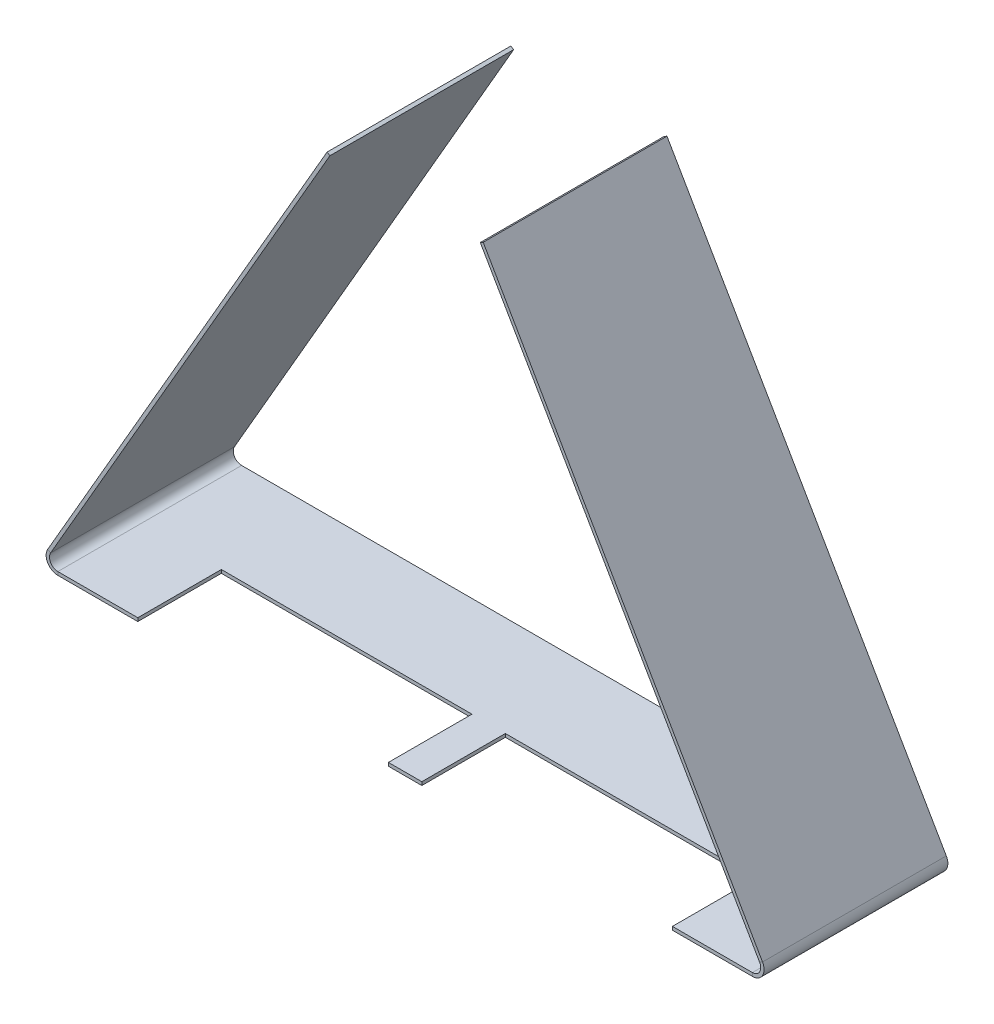
ISO-10303-21;
HEADER;
FILE_DESCRIPTION(('STEP AP214'),'2;1');
FILE_NAME('part.step','',(''),(''),'','','');
FILE_SCHEMA(('AUTOMOTIVE_DESIGN { 1 0 10303 214 1 1 1 1 }'));
ENDSEC;
DATA;
#1=APPLICATION_CONTEXT('core data for automotive mechanical design processes');
#2=APPLICATION_PROTOCOL_DEFINITION('international standard','automotive_design',2000,#1);
#3=PRODUCT_CONTEXT('',#1,'mechanical');
#4=PRODUCT('Part','Part','',(#3));
#5=PRODUCT_RELATED_PRODUCT_CATEGORY('part','',(#4));
#6=PRODUCT_DEFINITION_FORMATION('','',#4);
#7=PRODUCT_DEFINITION_CONTEXT('part definition',#1,'design');
#8=PRODUCT_DEFINITION('design','',#6,#7);
#9=PRODUCT_DEFINITION_SHAPE('','',#8);
#10=(LENGTH_UNIT() NAMED_UNIT(*) SI_UNIT(.MILLI.,.METRE.));
#11=(NAMED_UNIT(*) PLANE_ANGLE_UNIT() SI_UNIT($,.RADIAN.));
#12=(NAMED_UNIT(*) SI_UNIT($,.STERADIAN.) SOLID_ANGLE_UNIT());
#13=UNCERTAINTY_MEASURE_WITH_UNIT(LENGTH_MEASURE(1.E-05),#10,'distance_accuracy_value','');
#14=(GEOMETRIC_REPRESENTATION_CONTEXT(3) GLOBAL_UNCERTAINTY_ASSIGNED_CONTEXT((#13)) GLOBAL_UNIT_ASSIGNED_CONTEXT((#10,
#11,#12)) REPRESENTATION_CONTEXT('',''));
#15=CARTESIAN_POINT('',(0.,0.,0.));
#16=DIRECTION('',(0.,0.,1.));
#17=DIRECTION('',(1.,0.,0.));
#18=AXIS2_PLACEMENT_3D('',#15,#16,#17);
#19=CARTESIAN_POINT('',(-219.999999999998,1.66533453693773E-13,110.));
#20=DIRECTION('',(0.,0.,0.999999999999999));
#21=DIRECTION('',(0.999999999999995,0.,0.));
#22=AXIS2_PLACEMENT_3D('',#19,#20,#21);
#23=PLANE('',#22);
#24=DIRECTION('',(0.,-0.999999999999995,0.));
#25=VECTOR('',#24,1.);
#26=CARTESIAN_POINT('',(207.87343833642,-1.11022302462516E-13,110.000000000001));
#27=LINE('',#26,#25);
#28=CARTESIAN_POINT('',(207.87343833642,2.00000000000011,110.));
#29=VERTEX_POINT('',#28);
#30=CARTESIAN_POINT('',(207.87343833642,-1.11022302462516E-13,110.000000000001));
#31=VERTEX_POINT('',#30);
#32=EDGE_CURVE('E11',#29,#31,#27,.T.);
#33=ORIENTED_EDGE('',*,*,#32,.F.);
#34=DIRECTION('',(-0.999999999999995,0.,0.));
#35=VECTOR('',#34,1.);
#36=CARTESIAN_POINT('',(-219.999999999998,2.,109.999999999998));
#37=LINE('',#36,#35);
#38=CARTESIAN_POINT('',(160.,2.00000000000006,109.999999999999));
#39=VERTEX_POINT('',#38);
#40=EDGE_CURVE('E157',#39,#29,#37,.F.);
#41=ORIENTED_EDGE('',*,*,#40,.F.);
#42=DIRECTION('',(0.,-0.999999999999995,0.));
#43=VECTOR('',#42,1.);
#44=CARTESIAN_POINT('',(160.,0.,110.));
#45=LINE('',#44,#43);
#46=CARTESIAN_POINT('',(160.,0.,110.));
#47=VERTEX_POINT('',#46);
#48=EDGE_CURVE('E48',#39,#47,#45,.T.);
#49=ORIENTED_EDGE('',*,*,#48,.T.);
#50=DIRECTION('',(0.999999999999995,0.,0.));
#51=VECTOR('',#50,1.);
#52=CARTESIAN_POINT('',(-219.999999999998,1.66533453693773E-13,110.));
#53=LINE('',#52,#51);
#54=EDGE_CURVE('E263',#47,#31,#53,.T.);
#55=ORIENTED_EDGE('',*,*,#54,.T.);
#56=EDGE_LOOP('',(#33,#41,#49,#55));
#57=FACE_BOUND('',#56,.T.);
#58=ADVANCED_FACE('F38',(#57),#23,.T.);
#59=CARTESIAN_POINT('',(160.,0.,110.));
#60=DIRECTION('',(-0.999999999999995,0.,0.));
#61=DIRECTION('',(0.,0.,0.999999999999999));
#62=AXIS2_PLACEMENT_3D('',#59,#60,#61);
#63=PLANE('',#62);
#64=ORIENTED_EDGE('',*,*,#48,.F.);
#65=DIRECTION('',(0.,0.,0.999999999999999));
#66=VECTOR('',#65,1.);
#67=CARTESIAN_POINT('',(160.,2.00000000000006,109.999999999999));
#68=LINE('',#67,#66);
#69=CARTESIAN_POINT('',(159.999999999999,2.00000000000028,60.0000000000007));
#70=VERTEX_POINT('',#69);
#71=EDGE_CURVE('E210',#70,#39,#68,.T.);
#72=ORIENTED_EDGE('',*,*,#71,.F.);
#73=DIRECTION('',(0.,-0.999999999999995,0.));
#74=VECTOR('',#73,1.);
#75=CARTESIAN_POINT('',(159.999999999999,3.88578058618805E-13,60.0000000000014));
#76=LINE('',#75,#74);
#77=CARTESIAN_POINT('',(159.999999999999,3.88578058618805E-13,60.0000000000014));
#78=VERTEX_POINT('',#77);
#79=EDGE_CURVE('E257',#70,#78,#76,.T.);
#80=ORIENTED_EDGE('',*,*,#79,.T.);
#81=DIRECTION('',(0.,0.,0.999999999999999));
#82=VECTOR('',#81,1.);
#83=CARTESIAN_POINT('',(160.,0.,110.));
#84=LINE('',#83,#82);
#85=EDGE_CURVE('E275',#78,#47,#84,.T.);
#86=ORIENTED_EDGE('',*,*,#85,.T.);
#87=EDGE_LOOP('',(#64,#72,#80,#86));
#88=FACE_BOUND('',#87,.T.);
#89=ADVANCED_FACE('F283',(#88),#63,.T.);
#90=CARTESIAN_POINT('',(159.999999999999,3.88578058618805E-13,60.0000000000014));
#91=DIRECTION('',(0.,0.,0.999999999999999));
#92=DIRECTION('',(0.999999999999995,0.,0.));
#93=AXIS2_PLACEMENT_3D('',#90,#91,#92);
#94=PLANE('',#93);
#95=ORIENTED_EDGE('',*,*,#79,.F.);
#96=DIRECTION('',(-0.999999999999995,0.,0.));
#97=VECTOR('',#96,1.);
#98=CARTESIAN_POINT('',(-219.999999999999,2.00000000000045,59.9999999999998));
#99=LINE('',#98,#97);
#100=CARTESIAN_POINT('',(10.0000000000002,1.99999999999989,60.0000000000004));
#101=VERTEX_POINT('',#100);
#102=EDGE_CURVE('E207',#101,#70,#99,.F.);
#103=ORIENTED_EDGE('',*,*,#102,.F.);
#104=DIRECTION('',(0.,-0.999999999999995,0.));
#105=VECTOR('',#104,1.);
#106=CARTESIAN_POINT('',(10.0000000000001,3.33066907387547E-13,60.0000000000014));
#107=LINE('',#106,#105);
#108=CARTESIAN_POINT('',(10.0000000000001,3.33066907387547E-13,60.0000000000014));
#109=VERTEX_POINT('',#108);
#110=EDGE_CURVE('E254',#101,#109,#107,.T.);
#111=ORIENTED_EDGE('',*,*,#110,.T.);
#112=DIRECTION('',(0.999999999999995,0.,0.));
#113=VECTOR('',#112,1.);
#114=CARTESIAN_POINT('',(159.999999999999,3.88578058618805E-13,60.0000000000014));
#115=LINE('',#114,#113);
#116=EDGE_CURVE('E284',#109,#78,#115,.T.);
#117=ORIENTED_EDGE('',*,*,#116,.T.);
#118=EDGE_LOOP('',(#95,#103,#111,#117));
#119=FACE_BOUND('',#118,.T.);
#120=ADVANCED_FACE('F426',(#119),#94,.T.);
#121=CARTESIAN_POINT('',(9.99999999999988,0.,110.));
#122=DIRECTION('',(0.999999999999995,0.,0.));
#123=DIRECTION('',(0.,0.,-1.));
#124=AXIS2_PLACEMENT_3D('',#121,#122,#123);
#125=PLANE('',#124);
#126=ORIENTED_EDGE('',*,*,#110,.F.);
#127=DIRECTION('',(0.,0.,0.999999999999999));
#128=VECTOR('',#127,1.);
#129=CARTESIAN_POINT('',(9.99999999999988,1.99999999999989,109.999999999999));
#130=LINE('',#129,#128);
#131=CARTESIAN_POINT('',(9.99999999999988,1.99999999999989,109.999999999999));
#132=VERTEX_POINT('',#131);
#133=EDGE_CURVE('E204',#132,#101,#130,.F.);
#134=ORIENTED_EDGE('',*,*,#133,.F.);
#135=DIRECTION('',(0.,-0.999999999999995,0.));
#136=VECTOR('',#135,1.);
#137=CARTESIAN_POINT('',(9.99999999999988,0.,110.));
#138=LINE('',#137,#136);
#139=CARTESIAN_POINT('',(9.99999999999988,0.,110.));
#140=VERTEX_POINT('',#139);
#141=EDGE_CURVE('E251',#132,#140,#138,.T.);
#142=ORIENTED_EDGE('',*,*,#141,.T.);
#143=DIRECTION('',(0.,0.,-1.));
#144=VECTOR('',#143,1.);
#145=CARTESIAN_POINT('',(9.99999999999988,0.,110.));
#146=LINE('',#145,#144);
#147=EDGE_CURVE('E286',#140,#109,#146,.T.);
#148=ORIENTED_EDGE('',*,*,#147,.T.);
#149=EDGE_LOOP('',(#126,#134,#142,#148));
#150=FACE_BOUND('',#149,.T.);
#151=ADVANCED_FACE('F431',(#150),#125,.T.);
#152=ORIENTED_EDGE('',*,*,#141,.F.);
#153=DIRECTION('',(-0.999999999999995,0.,0.));
#154=VECTOR('',#153,1.);
#155=CARTESIAN_POINT('',(-219.999999999998,2.,109.999999999998));
#156=LINE('',#155,#154);
#157=CARTESIAN_POINT('',(-9.99999999999985,2.00000000000006,110.));
#158=VERTEX_POINT('',#157);
#159=EDGE_CURVE('E201',#158,#132,#156,.F.);
#160=ORIENTED_EDGE('',*,*,#159,.F.);
#161=DIRECTION('',(0.,-0.999999999999995,0.));
#162=VECTOR('',#161,1.);
#163=CARTESIAN_POINT('',(-9.99999999999985,2.22044604925031E-13,110.000000000001));
#164=LINE('',#163,#162);
#165=CARTESIAN_POINT('',(-9.99999999999985,2.22044604925031E-13,110.000000000001));
#166=VERTEX_POINT('',#165);
#167=EDGE_CURVE('E248',#158,#166,#164,.T.);
#168=ORIENTED_EDGE('',*,*,#167,.T.);
#169=EDGE_CURVE('E282',#166,#140,#53,.T.);
#170=ORIENTED_EDGE('',*,*,#169,.T.);
#171=EDGE_LOOP('',(#152,#160,#168,#170));
#172=FACE_BOUND('',#171,.T.);
#173=ADVANCED_FACE('F421',(#172),#23,.T.);
#174=CARTESIAN_POINT('',(-9.99999999999985,2.22044604925031E-13,110.000000000001));
#175=DIRECTION('',(-0.999999999999995,0.,0.));
#176=DIRECTION('',(0.,0.,0.999999999999999));
#177=AXIS2_PLACEMENT_3D('',#174,#175,#176);
#178=PLANE('',#177);
#179=ORIENTED_EDGE('',*,*,#167,.F.);
#180=DIRECTION('',(0.,0.,0.999999999999999));
#181=VECTOR('',#180,1.);
#182=CARTESIAN_POINT('',(-9.99999999999985,2.00000000000006,110.));
#183=LINE('',#182,#181);
#184=CARTESIAN_POINT('',(-9.99999999999965,2.00000000000022,60.0000000000002));
#185=VERTEX_POINT('',#184);
#186=EDGE_CURVE('E198',#185,#158,#183,.T.);
#187=ORIENTED_EDGE('',*,*,#186,.F.);
#188=DIRECTION('',(0.,-0.999999999999995,0.));
#189=VECTOR('',#188,1.);
#190=CARTESIAN_POINT('',(-9.99999999999991,3.88578058618805E-13,60.0000000000025));
#191=LINE('',#190,#189);
#192=CARTESIAN_POINT('',(-9.99999999999991,3.88578058618805E-13,60.0000000000025));
#193=VERTEX_POINT('',#192);
#194=EDGE_CURVE('E245',#185,#193,#191,.T.);
#195=ORIENTED_EDGE('',*,*,#194,.T.);
#196=DIRECTION('',(0.,0.,0.999999999999999));
#197=VECTOR('',#196,1.);
#198=CARTESIAN_POINT('',(-9.99999999999985,2.22044604925031E-13,110.000000000001));
#199=LINE('',#198,#197);
#200=EDGE_CURVE('E291',#193,#166,#199,.T.);
#201=ORIENTED_EDGE('',*,*,#200,.T.);
#202=EDGE_LOOP('',(#179,#187,#195,#201));
#203=FACE_BOUND('',#202,.T.);
#204=ADVANCED_FACE('F430',(#203),#178,.T.);
#205=CARTESIAN_POINT('',(-159.999999999999,3.33066907387547E-13,60.000000000002));
#206=DIRECTION('',(0.,0.,0.999999999999999));
#207=DIRECTION('',(0.999999999999995,0.,0.));
#208=AXIS2_PLACEMENT_3D('',#205,#206,#207);
#209=PLANE('',#208);
#210=ORIENTED_EDGE('',*,*,#194,.F.);
#211=DIRECTION('',(-0.999999999999995,0.,0.));
#212=VECTOR('',#211,1.);
#213=CARTESIAN_POINT('',(-219.999999999999,2.00000000000045,59.9999999999998));
#214=LINE('',#213,#212);
#215=CARTESIAN_POINT('',(-159.999999999999,2.00000000000033,60.0000000000002));
#216=VERTEX_POINT('',#215);
#217=EDGE_CURVE('E195',#216,#185,#214,.F.);
#218=ORIENTED_EDGE('',*,*,#217,.F.);
#219=DIRECTION('',(0.,-0.999999999999995,0.));
#220=VECTOR('',#219,1.);
#221=CARTESIAN_POINT('',(-159.999999999999,3.33066907387547E-13,60.000000000002));
#222=LINE('',#221,#220);
#223=CARTESIAN_POINT('',(-159.999999999999,3.33066907387547E-13,60.000000000002));
#224=VERTEX_POINT('',#223);
#225=EDGE_CURVE('E242',#216,#224,#222,.T.);
#226=ORIENTED_EDGE('',*,*,#225,.T.);
#227=DIRECTION('',(0.999999999999995,0.,0.));
#228=VECTOR('',#227,1.);
#229=CARTESIAN_POINT('',(-159.999999999999,3.33066907387547E-13,60.000000000002));
#230=LINE('',#229,#228);
#231=EDGE_CURVE('E294',#224,#193,#230,.T.);
#232=ORIENTED_EDGE('',*,*,#231,.T.);
#233=EDGE_LOOP('',(#210,#218,#226,#232));
#234=FACE_BOUND('',#233,.T.);
#235=ADVANCED_FACE('F440',(#234),#209,.T.);
#236=CARTESIAN_POINT('',(-159.999999999999,2.77555756156289E-13,110.));
#237=DIRECTION('',(0.999999999999995,0.,0.));
#238=DIRECTION('',(0.,0.,-0.999999999999999));
#239=AXIS2_PLACEMENT_3D('',#236,#237,#238);
#240=PLANE('',#239);
#241=ORIENTED_EDGE('',*,*,#225,.F.);
#242=DIRECTION('',(0.,0.,0.999999999999999));
#243=VECTOR('',#242,1.);
#244=CARTESIAN_POINT('',(-159.999999999999,2.00000000000011,110.));
#245=LINE('',#244,#243);
#246=CARTESIAN_POINT('',(-159.999999999999,2.00000000000011,110.));
#247=VERTEX_POINT('',#246);
#248=EDGE_CURVE('E192',#247,#216,#245,.F.);
#249=ORIENTED_EDGE('',*,*,#248,.F.);
#250=DIRECTION('',(0.,-0.999999999999995,0.));
#251=VECTOR('',#250,1.);
#252=CARTESIAN_POINT('',(-159.999999999999,2.77555756156289E-13,110.));
#253=LINE('',#252,#251);
#254=CARTESIAN_POINT('',(-159.999999999999,2.77555756156289E-13,110.));
#255=VERTEX_POINT('',#254);
#256=EDGE_CURVE('E239',#247,#255,#253,.T.);
#257=ORIENTED_EDGE('',*,*,#256,.T.);
#258=DIRECTION('',(0.,0.,-0.999999999999999));
#259=VECTOR('',#258,1.);
#260=CARTESIAN_POINT('',(-159.999999999999,2.77555756156289E-13,110.));
#261=LINE('',#260,#259);
#262=EDGE_CURVE('E297',#255,#224,#261,.T.);
#263=ORIENTED_EDGE('',*,*,#262,.T.);
#264=EDGE_LOOP('',(#241,#249,#257,#263));
#265=FACE_BOUND('',#264,.T.);
#266=ADVANCED_FACE('F434',(#265),#240,.T.);
#267=ORIENTED_EDGE('',*,*,#256,.F.);
#268=DIRECTION('',(-0.999999999999995,0.,0.));
#269=VECTOR('',#268,1.);
#270=CARTESIAN_POINT('',(-219.999999999998,2.,109.999999999998));
#271=LINE('',#270,#269);
#272=CARTESIAN_POINT('',(-207.873438336419,2.00000000000011,109.999999999999));
#273=VERTEX_POINT('',#272);
#274=EDGE_CURVE('E178',#273,#247,#271,.F.);
#275=ORIENTED_EDGE('',*,*,#274,.F.);
#276=DIRECTION('',(0.,-0.999999999999995,0.));
#277=VECTOR('',#276,1.);
#278=CARTESIAN_POINT('',(-207.873438336419,2.22044604925031E-13,110.));
#279=LINE('',#278,#277);
#280=CARTESIAN_POINT('',(-207.873438336419,2.22044604925031E-13,110.));
#281=VERTEX_POINT('',#280);
#282=EDGE_CURVE('E236',#273,#281,#279,.T.);
#283=ORIENTED_EDGE('',*,*,#282,.T.);
#284=EDGE_CURVE('E281',#281,#255,#53,.T.);
#285=ORIENTED_EDGE('',*,*,#284,.T.);
#286=EDGE_LOOP('',(#267,#275,#283,#285));
#287=FACE_BOUND('',#286,.T.);
#288=ADVANCED_FACE('F422',(#287),#23,.T.);
#289=CARTESIAN_POINT('',(-207.873438336419,7.00000000000023,109.999999999999));
#290=DIRECTION('',(0.,0.,-0.999999999999999));
#291=DIRECTION('',(-0.999999999999995,0.,0.));
#292=AXIS2_PLACEMENT_3D('',#289,#290,#291);
#293=PLANE('',#292);
#294=ORIENTED_EDGE('',*,*,#282,.F.);
#295=CARTESIAN_POINT('',(-207.873438336419,7.00000000000023,109.999999999999));
#296=DIRECTION('',(0.,0.,-0.999999999999999));
#297=DIRECTION('',(-0.999999999999995,0.,0.));
#298=AXIS2_PLACEMENT_3D('',#295,#296,#297);
#299=CIRCLE('',#298,5.);
#300=CARTESIAN_POINT('',(-212.203171424887,9.50068218344968,110.));
#301=VERTEX_POINT('',#300);
#302=EDGE_CURVE('E173',#273,#301,#299,.T.);
#303=ORIENTED_EDGE('',*,*,#302,.T.);
#304=DIRECTION('',(-0.865946617693628,0.500136436689981,0.));
#305=VECTOR('',#304,1.);
#306=CARTESIAN_POINT('',(-213.935064660274,10.5009550568302,110.));
#307=LINE('',#306,#305);
#308=CARTESIAN_POINT('',(-213.935064660274,10.5009550568302,110.));
#309=VERTEX_POINT('',#308);
#310=EDGE_CURVE('E56',#301,#309,#307,.T.);
#311=ORIENTED_EDGE('',*,*,#310,.T.);
#312=CARTESIAN_POINT('',(-207.873438336419,7.00000000000023,109.999999999999));
#313=DIRECTION('',(0.,0.,0.999999999999999));
#314=DIRECTION('',(0.999999999999995,0.,0.));
#315=AXIS2_PLACEMENT_3D('',#312,#313,#314);
#316=CIRCLE('',#315,7.);
#317=EDGE_CURVE('E327',#281,#309,#316,.F.);
#318=ORIENTED_EDGE('',*,*,#317,.F.);
#319=EDGE_LOOP('',(#294,#303,#311,#318));
#320=FACE_BOUND('',#319,.T.);
#321=ADVANCED_FACE('F354',(#320),#293,.F.);
#322=CARTESIAN_POINT('',(-46.7318932353872,299.999999999998,110.));
#323=DIRECTION('',(0.,0.,0.999999999999999));
#324=DIRECTION('',(-0.500136436689983,-0.865946617693628,0.));
#325=AXIS2_PLACEMENT_3D('',#322,#323,#324);
#326=PLANE('',#325);
#327=ORIENTED_EDGE('',*,*,#310,.F.);
#328=DIRECTION('',(0.500136436689983,0.865946617693628,0.));
#329=VECTOR('',#328,1.);
#330=CARTESIAN_POINT('',(-44.9999999999999,298.999727126619,110.));
#331=LINE('',#330,#329);
#332=CARTESIAN_POINT('',(-44.9999999999999,298.999727126619,110.));
#333=VERTEX_POINT('',#332);
#334=EDGE_CURVE('E184',#333,#301,#331,.F.);
#335=ORIENTED_EDGE('',*,*,#334,.F.);
#336=DIRECTION('',(-0.865946617693628,0.500136436689981,0.));
#337=VECTOR('',#336,1.);
#338=CARTESIAN_POINT('',(-46.7318932353872,299.999999999998,110.));
#339=LINE('',#338,#337);
#340=CARTESIAN_POINT('',(-46.7318932353872,299.999999999998,110.));
#341=VERTEX_POINT('',#340);
#342=EDGE_CURVE('E232',#333,#341,#339,.T.);
#343=ORIENTED_EDGE('',*,*,#342,.T.);
#344=DIRECTION('',(-0.500136436689983,-0.865946617693628,0.));
#345=VECTOR('',#344,1.);
#346=CARTESIAN_POINT('',(-46.7318932353872,299.999999999998,110.));
#347=LINE('',#346,#345);
#348=EDGE_CURVE('E305',#341,#309,#347,.T.);
#349=ORIENTED_EDGE('',*,*,#348,.T.);
#350=EDGE_LOOP('',(#327,#335,#343,#349));
#351=FACE_BOUND('',#350,.T.);
#352=ADVANCED_FACE('F439',(#351),#326,.T.);
#353=CARTESIAN_POINT('',(-46.7318932353872,299.999999999998,110.));
#354=DIRECTION('',(-0.500136436689983,-0.865946617693628,0.));
#355=DIRECTION('',(0.,0.,-0.999999999999999));
#356=AXIS2_PLACEMENT_3D('',#353,#354,#355);
#357=PLANE('',#356);
#358=ORIENTED_EDGE('',*,*,#342,.F.);
#359=DIRECTION('',(0.,0.,0.999999999999999));
#360=VECTOR('',#359,1.);
#361=CARTESIAN_POINT('',(-44.9999999999999,298.999727126619,110.));
#362=LINE('',#361,#360);
#363=CARTESIAN_POINT('',(-45.,298.999727126618,-6.66133814775094E-13));
#364=VERTEX_POINT('',#363);
#365=EDGE_CURVE('E171',#333,#364,#362,.F.);
#366=ORIENTED_EDGE('',*,*,#365,.T.);
#367=DIRECTION('',(-0.865946617693628,0.500136436689981,0.));
#368=VECTOR('',#367,1.);
#369=CARTESIAN_POINT('',(-46.7318932353872,299.999999999999,1.99840144432528E-12));
#370=LINE('',#369,#368);
#371=CARTESIAN_POINT('',(-46.7318932353872,299.999999999999,1.99840144432528E-12));
#372=VERTEX_POINT('',#371);
#373=EDGE_CURVE('E229',#364,#372,#370,.T.);
#374=ORIENTED_EDGE('',*,*,#373,.T.);
#375=DIRECTION('',(0.,0.,-0.999999999999999));
#376=VECTOR('',#375,1.);
#377=CARTESIAN_POINT('',(-46.7318932353872,299.999999999998,110.));
#378=LINE('',#377,#376);
#379=EDGE_CURVE('E308',#341,#372,#378,.T.);
#380=ORIENTED_EDGE('',*,*,#379,.F.);
#381=EDGE_LOOP('',(#358,#366,#374,#380));
#382=FACE_BOUND('',#381,.T.);
#383=ADVANCED_FACE('F379',(#382),#357,.F.);
#384=CARTESIAN_POINT('',(-46.7318932353872,299.999999999999,1.99840144432528E-12));
#385=DIRECTION('',(0.,0.,0.999999999999999));
#386=DIRECTION('',(-0.500136436689983,-0.865946617693628,0.));
#387=AXIS2_PLACEMENT_3D('',#384,#385,#386);
#388=PLANE('',#387);
#389=ORIENTED_EDGE('',*,*,#373,.F.);
#390=DIRECTION('',(0.500136436689983,0.865946617693628,0.));
#391=VECTOR('',#390,1.);
#392=CARTESIAN_POINT('',(-45.,298.999727126618,-6.66133814775094E-13));
#393=LINE('',#392,#391);
#394=CARTESIAN_POINT('',(-212.203171424887,9.50068218345024,1.33226762955019E-12));
#395=VERTEX_POINT('',#394);
#396=EDGE_CURVE('E177',#364,#395,#393,.F.);
#397=ORIENTED_EDGE('',*,*,#396,.T.);
#398=DIRECTION('',(-0.865946617693632,0.500136436689974,0.));
#399=VECTOR('',#398,1.);
#400=CARTESIAN_POINT('',(-213.935064660275,10.5009550568299,4.44089209850063E-13));
#401=LINE('',#400,#399);
#402=CARTESIAN_POINT('',(-213.935064660275,10.5009550568299,4.44089209850063E-13));
#403=VERTEX_POINT('',#402);
#404=EDGE_CURVE('E227',#395,#403,#401,.T.);
#405=ORIENTED_EDGE('',*,*,#404,.T.);
#406=DIRECTION('',(-0.500136436689983,-0.865946617693628,0.));
#407=VECTOR('',#406,1.);
#408=CARTESIAN_POINT('',(-46.7318932353872,299.999999999999,1.99840144432528E-12));
#409=LINE('',#408,#407);
#410=EDGE_CURVE('E302',#372,#403,#409,.T.);
#411=ORIENTED_EDGE('',*,*,#410,.F.);
#412=EDGE_LOOP('',(#389,#397,#405,#411));
#413=FACE_BOUND('',#412,.T.);
#414=ADVANCED_FACE('F369',(#413),#388,.F.);
#415=CARTESIAN_POINT('',(-207.873438336419,7.00000000000023,-1.77635683940025E-12));
#416=DIRECTION('',(0.,0.,0.999999999999999));
#417=DIRECTION('',(0.999999999999995,0.,0.));
#418=AXIS2_PLACEMENT_3D('',#415,#416,#417);
#419=PLANE('',#418);
#420=ORIENTED_EDGE('',*,*,#404,.F.);
#421=CARTESIAN_POINT('',(-207.873438336419,7.00000000000023,-1.77635683940025E-12));
#422=DIRECTION('',(0.,0.,-0.999999999999999));
#423=DIRECTION('',(-0.999999999999995,0.,0.));
#424=AXIS2_PLACEMENT_3D('',#421,#422,#423);
#425=CIRCLE('',#424,5.);
#426=CARTESIAN_POINT('',(-207.873438336419,2.00000000000011,-1.38777878078145E-12));
#427=VERTEX_POINT('',#426);
#428=EDGE_CURVE('E179',#395,#427,#425,.F.);
#429=ORIENTED_EDGE('',*,*,#428,.T.);
#430=DIRECTION('',(0.,-0.999999999999995,0.));
#431=VECTOR('',#430,1.);
#432=CARTESIAN_POINT('',(-207.873438336419,0.,6.10622663543836E-13));
#433=LINE('',#432,#431);
#434=CARTESIAN_POINT('',(-207.873438336419,0.,6.10622663543836E-13));
#435=VERTEX_POINT('',#434);
#436=EDGE_CURVE('E224',#427,#435,#433,.T.);
#437=ORIENTED_EDGE('',*,*,#436,.T.);
#438=CARTESIAN_POINT('',(-207.873438336419,7.00000000000023,-1.77635683940025E-12));
#439=DIRECTION('',(0.,0.,-0.999999999999999));
#440=DIRECTION('',(-0.999999999999995,0.,0.));
#441=AXIS2_PLACEMENT_3D('',#438,#439,#440);
#442=CIRCLE('',#441,7.);
#443=EDGE_CURVE('E333',#403,#435,#442,.F.);
#444=ORIENTED_EDGE('',*,*,#443,.F.);
#445=EDGE_LOOP('',(#420,#429,#437,#444));
#446=FACE_BOUND('',#445,.T.);
#447=ADVANCED_FACE('F363',(#446),#419,.F.);
#448=CARTESIAN_POINT('',(-219.999999999999,0.,-2.22044604925031E-13));
#449=DIRECTION('',(0.,0.,0.999999999999999));
#450=DIRECTION('',(0.999999999999995,0.,0.));
#451=AXIS2_PLACEMENT_3D('',#448,#449,#450);
#452=PLANE('',#451);
#453=ORIENTED_EDGE('',*,*,#436,.F.);
#454=DIRECTION('',(-0.999999999999995,0.,0.));
#455=VECTOR('',#454,1.);
#456=CARTESIAN_POINT('',(-219.999999999999,2.00000000000006,-2.22044604925031E-13));
#457=LINE('',#456,#455);
#458=CARTESIAN_POINT('',(207.87343833642,2.00000000000011,-4.9960036108132E-13));
#459=VERTEX_POINT('',#458);
#460=EDGE_CURVE('E174',#427,#459,#457,.F.);
#461=ORIENTED_EDGE('',*,*,#460,.T.);
#462=DIRECTION('',(0.,-0.999999999999995,0.));
#463=VECTOR('',#462,1.);
#464=CARTESIAN_POINT('',(207.87343833642,0.,3.88578058618805E-13));
#465=LINE('',#464,#463);
#466=CARTESIAN_POINT('',(207.87343833642,0.,3.88578058618805E-13));
#467=VERTEX_POINT('',#466);
#468=EDGE_CURVE('E221',#459,#467,#465,.T.);
#469=ORIENTED_EDGE('',*,*,#468,.T.);
#470=DIRECTION('',(0.999999999999995,0.,0.));
#471=VECTOR('',#470,1.);
#472=CARTESIAN_POINT('',(-219.999999999999,0.,-2.22044604925031E-13));
#473=LINE('',#472,#471);
#474=EDGE_CURVE('E300',#435,#467,#473,.T.);
#475=ORIENTED_EDGE('',*,*,#474,.F.);
#476=EDGE_LOOP('',(#453,#461,#469,#475));
#477=FACE_BOUND('',#476,.T.);
#478=ADVANCED_FACE('F396',(#477),#452,.F.);
#479=CARTESIAN_POINT('',(207.87343833642,7.00000000000001,-7.21644966006352E-13));
#480=DIRECTION('',(0.,0.,0.999999999999999));
#481=DIRECTION('',(0.999999999999995,0.,0.));
#482=AXIS2_PLACEMENT_3D('',#479,#480,#481);
#483=PLANE('',#482);
#484=ORIENTED_EDGE('',*,*,#468,.F.);
#485=CARTESIAN_POINT('',(207.87343833642,7.00000000000001,-7.21644966006352E-13));
#486=DIRECTION('',(0.,0.,-0.999999999999999));
#487=DIRECTION('',(-0.999999999999995,0.,0.));
#488=AXIS2_PLACEMENT_3D('',#485,#486,#487);
#489=CIRCLE('',#488,5.);
#490=CARTESIAN_POINT('',(212.203171424888,9.50068218345002,1.49880108324396E-12));
#491=VERTEX_POINT('',#490);
#492=EDGE_CURVE('E158',#459,#491,#489,.F.);
#493=ORIENTED_EDGE('',*,*,#492,.T.);
#494=DIRECTION('',(0.865946617693628,0.50013643668998,0.));
#495=VECTOR('',#494,1.);
#496=CARTESIAN_POINT('',(213.935064660275,10.5009550568302,0.));
#497=LINE('',#496,#495);
#498=CARTESIAN_POINT('',(213.935064660275,10.5009550568302,0.));
#499=VERTEX_POINT('',#498);
#500=EDGE_CURVE('E218',#491,#499,#497,.T.);
#501=ORIENTED_EDGE('',*,*,#500,.T.);
#502=CARTESIAN_POINT('',(207.87343833642,7.00000000000001,-7.21644966006352E-13));
#503=DIRECTION('',(0.,0.,-0.999999999999999));
#504=DIRECTION('',(-0.999999999999995,0.,0.));
#505=AXIS2_PLACEMENT_3D('',#502,#503,#504);
#506=CIRCLE('',#505,7.);
#507=EDGE_CURVE('E324',#467,#499,#506,.F.);
#508=ORIENTED_EDGE('',*,*,#507,.F.);
#509=EDGE_LOOP('',(#484,#493,#501,#508));
#510=FACE_BOUND('',#509,.T.);
#511=ADVANCED_FACE('F399',(#510),#483,.F.);
#512=CARTESIAN_POINT('',(219.999999999999,0.,1.66533453693773E-13));
#513=DIRECTION('',(0.,0.,0.999999999999999));
#514=DIRECTION('',(-0.500136436689983,0.865946617693628,0.));
#515=AXIS2_PLACEMENT_3D('',#512,#513,#514);
#516=PLANE('',#515);
#517=ORIENTED_EDGE('',*,*,#500,.F.);
#518=DIRECTION('',(0.500136436689983,-0.865946617693628,0.));
#519=VECTOR('',#518,1.);
#520=CARTESIAN_POINT('',(218.268106764612,-1.00027287337989,2.22044604925031E-12));
#521=LINE('',#520,#519);
#522=CARTESIAN_POINT('',(45.0000000000001,298.999727126618,-1.33226762955019E-12));
#523=VERTEX_POINT('',#522);
#524=EDGE_CURVE('E148',#491,#523,#521,.F.);
#525=ORIENTED_EDGE('',*,*,#524,.T.);
#526=DIRECTION('',(0.865946617693628,0.50013643668998,0.));
#527=VECTOR('',#526,1.);
#528=CARTESIAN_POINT('',(46.7318932353874,299.999999999999,0.));
#529=LINE('',#528,#527);
#530=CARTESIAN_POINT('',(46.7318932353874,299.999999999999,0.));
#531=VERTEX_POINT('',#530);
#532=EDGE_CURVE('E215',#523,#531,#529,.T.);
#533=ORIENTED_EDGE('',*,*,#532,.T.);
#534=DIRECTION('',(-0.500136436689983,0.865946617693628,0.));
#535=VECTOR('',#534,1.);
#536=CARTESIAN_POINT('',(219.999999999999,0.,1.66533453693773E-13));
#537=LINE('',#536,#535);
#538=EDGE_CURVE('E311',#499,#531,#537,.T.);
#539=ORIENTED_EDGE('',*,*,#538,.F.);
#540=EDGE_LOOP('',(#517,#525,#533,#539));
#541=FACE_BOUND('',#540,.T.);
#542=ADVANCED_FACE('F410',(#541),#516,.F.);
#543=CARTESIAN_POINT('',(46.7318932353871,299.999999999998,110.));
#544=DIRECTION('',(-0.500136436689983,0.865946617693628,0.));
#545=DIRECTION('',(0.,0.,-0.999999999999999));
#546=AXIS2_PLACEMENT_3D('',#543,#544,#545);
#547=PLANE('',#546);
#548=ORIENTED_EDGE('',*,*,#532,.F.);
#549=DIRECTION('',(0.,0.,0.999999999999999));
#550=VECTOR('',#549,1.);
#551=CARTESIAN_POINT('',(45.,298.999727126619,110.));
#552=LINE('',#551,#550);
#553=CARTESIAN_POINT('',(45.,298.999727126619,110.));
#554=VERTEX_POINT('',#553);
#555=EDGE_CURVE('E163',#554,#523,#552,.F.);
#556=ORIENTED_EDGE('',*,*,#555,.F.);
#557=DIRECTION('',(0.865946617693628,0.50013643668998,0.));
#558=VECTOR('',#557,1.);
#559=CARTESIAN_POINT('',(46.7318932353871,299.999999999998,110.));
#560=LINE('',#559,#558);
#561=CARTESIAN_POINT('',(46.7318932353871,299.999999999998,110.));
#562=VERTEX_POINT('',#561);
#563=EDGE_CURVE('E137',#554,#562,#560,.T.);
#564=ORIENTED_EDGE('',*,*,#563,.T.);
#565=DIRECTION('',(0.,0.,-0.999999999999999));
#566=VECTOR('',#565,1.);
#567=CARTESIAN_POINT('',(46.7318932353871,299.999999999998,110.));
#568=LINE('',#567,#566);
#569=EDGE_CURVE('E314',#562,#531,#568,.T.);
#570=ORIENTED_EDGE('',*,*,#569,.T.);
#571=EDGE_LOOP('',(#548,#556,#564,#570));
#572=FACE_BOUND('',#571,.T.);
#573=ADVANCED_FACE('F408',(#572),#547,.T.);
#574=CARTESIAN_POINT('',(219.999999999999,-1.11022302462516E-13,110.));
#575=DIRECTION('',(0.,0.,0.999999999999999));
#576=DIRECTION('',(-0.500136436689983,0.865946617693628,0.));
#577=AXIS2_PLACEMENT_3D('',#574,#575,#576);
#578=PLANE('',#577);
#579=ORIENTED_EDGE('',*,*,#563,.F.);
#580=DIRECTION('',(0.500136436689983,-0.865946617693628,0.));
#581=VECTOR('',#580,1.);
#582=CARTESIAN_POINT('',(218.268106764612,-1.0002728733795,109.999999999998));
#583=LINE('',#582,#581);
#584=CARTESIAN_POINT('',(212.203171424888,9.50068218344985,110.000000000002));
#585=VERTEX_POINT('',#584);
#586=EDGE_CURVE('E146',#585,#554,#583,.F.);
#587=ORIENTED_EDGE('',*,*,#586,.F.);
#588=DIRECTION('',(0.865946617693629,0.500136436689979,0.));
#589=VECTOR('',#588,1.);
#590=CARTESIAN_POINT('',(213.935064660275,10.5009550568301,110.));
#591=LINE('',#590,#589);
#592=CARTESIAN_POINT('',(213.935064660275,10.5009550568301,110.));
#593=VERTEX_POINT('',#592);
#594=EDGE_CURVE('E42',#585,#593,#591,.T.);
#595=ORIENTED_EDGE('',*,*,#594,.T.);
#596=DIRECTION('',(-0.500136436689983,0.865946617693628,0.));
#597=VECTOR('',#596,1.);
#598=CARTESIAN_POINT('',(219.999999999999,-1.11022302462516E-13,110.));
#599=LINE('',#598,#597);
#600=EDGE_CURVE('E317',#593,#562,#599,.T.);
#601=ORIENTED_EDGE('',*,*,#600,.T.);
#602=EDGE_LOOP('',(#579,#587,#595,#601));
#603=FACE_BOUND('',#602,.T.);
#604=ADVANCED_FACE('F160',(#603),#578,.T.);
#605=CARTESIAN_POINT('',(207.87343833642,7.00000000000028,110.));
#606=DIRECTION('',(0.,0.,-0.999999999999999));
#607=DIRECTION('',(-0.999999999999995,0.,0.));
#608=AXIS2_PLACEMENT_3D('',#605,#606,#607);
#609=PLANE('',#608);
#610=CARTESIAN_POINT('',(207.87343833642,7.00000000000028,110.));
#611=DIRECTION('',(0.,0.,-0.999999999999999));
#612=DIRECTION('',(-0.999999999999995,0.,0.));
#613=AXIS2_PLACEMENT_3D('',#610,#611,#612);
#614=CIRCLE('',#613,5.);
#615=EDGE_CURVE('E129',#585,#29,#614,.T.);
#616=ORIENTED_EDGE('',*,*,#615,.T.);
#617=ORIENTED_EDGE('',*,*,#32,.T.);
#618=CARTESIAN_POINT('',(207.87343833642,7.00000000000028,110.));
#619=DIRECTION('',(0.,0.,0.999999999999999));
#620=DIRECTION('',(0.999999999999995,0.,0.));
#621=AXIS2_PLACEMENT_3D('',#618,#619,#620);
#622=CIRCLE('',#621,7.);
#623=EDGE_CURVE('E132',#593,#31,#622,.F.);
#624=ORIENTED_EDGE('',*,*,#623,.F.);
#625=ORIENTED_EDGE('',*,*,#594,.F.);
#626=EDGE_LOOP('',(#616,#617,#624,#625));
#627=FACE_BOUND('',#626,.T.);
#628=ADVANCED_FACE('F40',(#627),#609,.F.);
#629=CARTESIAN_POINT('',(219.999999999999,-1.11022302462516E-13,110.));
#630=DIRECTION('',(-0.865946617693628,-0.50013643668998,0.));
#631=DIRECTION('',(0.500136436689983,-0.865946617693628,0.));
#632=AXIS2_PLACEMENT_3D('',#629,#630,#631);
#633=PLANE('',#632);
#634=ORIENTED_EDGE('',*,*,#600,.F.);
#635=DIRECTION('',(0.,0.,-0.999999999999999));
#636=VECTOR('',#635,1.);
#637=CARTESIAN_POINT('',(213.935064660275,10.5009550568301,110.));
#638=LINE('',#637,#636);
#639=EDGE_CURVE('E319',#593,#499,#638,.T.);
#640=ORIENTED_EDGE('',*,*,#639,.T.);
#641=ORIENTED_EDGE('',*,*,#538,.T.);
#642=ORIENTED_EDGE('',*,*,#569,.F.);
#643=EDGE_LOOP('',(#634,#640,#641,#642));
#644=FACE_BOUND('',#643,.T.);
#645=ADVANCED_FACE('F405',(#644),#633,.F.);
#646=CARTESIAN_POINT('',(-46.7318932353872,299.999999999998,110.));
#647=DIRECTION('',(0.865946617693628,-0.500136436689981,0.));
#648=DIRECTION('',(0.500136436689983,0.865946617693628,0.));
#649=AXIS2_PLACEMENT_3D('',#646,#647,#648);
#650=PLANE('',#649);
#651=ORIENTED_EDGE('',*,*,#410,.T.);
#652=DIRECTION('',(0.,0.,-0.999999999999999));
#653=VECTOR('',#652,1.);
#654=CARTESIAN_POINT('',(-213.935064660274,10.5009550568302,110.));
#655=LINE('',#654,#653);
#656=EDGE_CURVE('E138',#403,#309,#655,.F.);
#657=ORIENTED_EDGE('',*,*,#656,.T.);
#658=ORIENTED_EDGE('',*,*,#348,.F.);
#659=ORIENTED_EDGE('',*,*,#379,.T.);
#660=EDGE_LOOP('',(#651,#657,#658,#659));
#661=FACE_BOUND('',#660,.T.);
#662=ADVANCED_FACE('F372',(#661),#650,.F.);
#663=CARTESIAN_POINT('',(-219.999999999998,1.66533453693773E-13,110.));
#664=DIRECTION('',(0.,0.999999999999995,0.));
#665=DIRECTION('',(-0.999999999999995,0.,0.));
#666=AXIS2_PLACEMENT_3D('',#663,#664,#665);
#667=PLANE('',#666);
#668=ORIENTED_EDGE('',*,*,#284,.F.);
#669=DIRECTION('',(0.,0.,-0.999999999999999));
#670=VECTOR('',#669,1.);
#671=CARTESIAN_POINT('',(-207.873438336419,2.22044604925031E-13,110.));
#672=LINE('',#671,#670);
#673=EDGE_CURVE('E323',#281,#435,#672,.T.);
#674=ORIENTED_EDGE('',*,*,#673,.T.);
#675=ORIENTED_EDGE('',*,*,#474,.T.);
#676=DIRECTION('',(0.,0.,-0.999999999999999));
#677=VECTOR('',#676,1.);
#678=CARTESIAN_POINT('',(207.87343833642,-1.11022302462516E-13,110.000000000001));
#679=LINE('',#678,#677);
#680=EDGE_CURVE('E279',#467,#31,#679,.F.);
#681=ORIENTED_EDGE('',*,*,#680,.T.);
#682=ORIENTED_EDGE('',*,*,#54,.F.);
#683=ORIENTED_EDGE('',*,*,#85,.F.);
#684=ORIENTED_EDGE('',*,*,#116,.F.);
#685=ORIENTED_EDGE('',*,*,#147,.F.);
#686=ORIENTED_EDGE('',*,*,#169,.F.);
#687=ORIENTED_EDGE('',*,*,#200,.F.);
#688=ORIENTED_EDGE('',*,*,#231,.F.);
#689=ORIENTED_EDGE('',*,*,#262,.F.);
#690=EDGE_LOOP('',(#668,#674,#675,#681,#682,#683,#684,#685,#686,#687,#688,#689));
#691=FACE_BOUND('',#690,.T.);
#692=ADVANCED_FACE('F273',(#691),#667,.F.);
#693=CARTESIAN_POINT('',(207.87343833642,7.00000000000028,110.));
#694=DIRECTION('',(0.,0.,-0.999999999999999));
#695=DIRECTION('',(-0.999999999999995,0.,0.));
#696=AXIS2_PLACEMENT_3D('',#693,#694,#695);
#697=CYLINDRICAL_SURFACE('',#696,7.);
#698=ORIENTED_EDGE('',*,*,#623,.T.);
#699=ORIENTED_EDGE('',*,*,#680,.F.);
#700=ORIENTED_EDGE('',*,*,#507,.T.);
#701=ORIENTED_EDGE('',*,*,#639,.F.);
#702=EDGE_LOOP('',(#698,#699,#700,#701));
#703=FACE_BOUND('',#702,.T.);
#704=ADVANCED_FACE('F403',(#703),#697,.T.);
#705=CARTESIAN_POINT('',(-207.873438336419,7.00000000000023,109.999999999999));
#706=DIRECTION('',(0.,0.,-0.999999999999999));
#707=DIRECTION('',(-0.999999999999995,0.,0.));
#708=AXIS2_PLACEMENT_3D('',#705,#706,#707);
#709=CYLINDRICAL_SURFACE('',#708,7.);
#710=ORIENTED_EDGE('',*,*,#317,.T.);
#711=ORIENTED_EDGE('',*,*,#656,.F.);
#712=ORIENTED_EDGE('',*,*,#443,.T.);
#713=ORIENTED_EDGE('',*,*,#673,.F.);
#714=EDGE_LOOP('',(#710,#711,#712,#713));
#715=FACE_BOUND('',#714,.T.);
#716=ADVANCED_FACE('F648',(#715),#709,.T.);
#717=CARTESIAN_POINT('',(218.268106764612,-1.0002728733795,109.999999999998));
#718=DIRECTION('',(-0.865946617693628,-0.50013643668998,0.));
#719=DIRECTION('',(0.500136436689983,-0.865946617693628,0.));
#720=AXIS2_PLACEMENT_3D('',#717,#718,#719);
#721=PLANE('',#720);
#722=ORIENTED_EDGE('',*,*,#586,.T.);
#723=ORIENTED_EDGE('',*,*,#555,.T.);
#724=ORIENTED_EDGE('',*,*,#524,.F.);
#725=DIRECTION('',(0.,0.,0.999999999999999));
#726=VECTOR('',#725,1.);
#727=CARTESIAN_POINT('',(212.203171424888,9.50068218344985,110.000000000002));
#728=LINE('',#727,#726);
#729=EDGE_CURVE('E143',#585,#491,#728,.F.);
#730=ORIENTED_EDGE('',*,*,#729,.F.);
#731=EDGE_LOOP('',(#722,#723,#724,#730));
#732=FACE_BOUND('',#731,.T.);
#733=ADVANCED_FACE('F144',(#732),#721,.T.);
#734=CARTESIAN_POINT('',(-44.9999999999999,298.999727126619,110.));
#735=DIRECTION('',(0.865946617693628,-0.500136436689981,0.));
#736=DIRECTION('',(0.500136436689983,0.865946617693628,0.));
#737=AXIS2_PLACEMENT_3D('',#734,#735,#736);
#738=PLANE('',#737);
#739=ORIENTED_EDGE('',*,*,#396,.F.);
#740=ORIENTED_EDGE('',*,*,#365,.F.);
#741=ORIENTED_EDGE('',*,*,#334,.T.);
#742=DIRECTION('',(0.,0.,0.999999999999999));
#743=VECTOR('',#742,1.);
#744=CARTESIAN_POINT('',(-212.203171424887,9.50068218344968,110.));
#745=LINE('',#744,#743);
#746=EDGE_CURVE('E167',#395,#301,#745,.T.);
#747=ORIENTED_EDGE('',*,*,#746,.F.);
#748=EDGE_LOOP('',(#739,#740,#741,#747));
#749=FACE_BOUND('',#748,.T.);
#750=ADVANCED_FACE('F352',(#749),#738,.T.);
#751=CARTESIAN_POINT('',(-219.999999999998,2.,109.999999999998));
#752=DIRECTION('',(0.,0.999999999999995,0.));
#753=DIRECTION('',(-0.999999999999995,0.,0.));
#754=AXIS2_PLACEMENT_3D('',#751,#752,#753);
#755=PLANE('',#754);
#756=ORIENTED_EDGE('',*,*,#274,.T.);
#757=ORIENTED_EDGE('',*,*,#248,.T.);
#758=ORIENTED_EDGE('',*,*,#217,.T.);
#759=ORIENTED_EDGE('',*,*,#186,.T.);
#760=ORIENTED_EDGE('',*,*,#159,.T.);
#761=ORIENTED_EDGE('',*,*,#133,.T.);
#762=ORIENTED_EDGE('',*,*,#102,.T.);
#763=ORIENTED_EDGE('',*,*,#71,.T.);
#764=ORIENTED_EDGE('',*,*,#40,.T.);
#765=DIRECTION('',(0.,0.,0.999999999999999));
#766=VECTOR('',#765,1.);
#767=CARTESIAN_POINT('',(207.87343833642,2.00000000000011,110.));
#768=LINE('',#767,#766);
#769=EDGE_CURVE('E152',#459,#29,#768,.T.);
#770=ORIENTED_EDGE('',*,*,#769,.F.);
#771=ORIENTED_EDGE('',*,*,#460,.F.);
#772=DIRECTION('',(0.,0.,0.999999999999999));
#773=VECTOR('',#772,1.);
#774=CARTESIAN_POINT('',(-207.873438336419,2.00000000000011,109.999999999999));
#775=LINE('',#774,#773);
#776=EDGE_CURVE('E337',#273,#427,#775,.F.);
#777=ORIENTED_EDGE('',*,*,#776,.F.);
#778=EDGE_LOOP('',(#756,#757,#758,#759,#760,#761,#762,#763,#764,#770,#771,#777));
#779=FACE_BOUND('',#778,.T.);
#780=ADVANCED_FACE('F359',(#779),#755,.T.);
#781=CARTESIAN_POINT('',(207.87343833642,7.00000000000028,110.));
#782=DIRECTION('',(0.,0.,-0.999999999999999));
#783=DIRECTION('',(-0.999999999999995,0.,0.));
#784=AXIS2_PLACEMENT_3D('',#781,#782,#783);
#785=CYLINDRICAL_SURFACE('',#784,5.);
#786=ORIENTED_EDGE('',*,*,#615,.F.);
#787=ORIENTED_EDGE('',*,*,#729,.T.);
#788=ORIENTED_EDGE('',*,*,#492,.F.);
#789=ORIENTED_EDGE('',*,*,#769,.T.);
#790=EDGE_LOOP('',(#786,#787,#788,#789));
#791=FACE_BOUND('',#790,.T.);
#792=ADVANCED_FACE('F154',(#791),#785,.F.);
#793=CARTESIAN_POINT('',(-207.873438336419,7.00000000000023,109.999999999999));
#794=DIRECTION('',(0.,0.,-0.999999999999999));
#795=DIRECTION('',(-0.999999999999995,0.,0.));
#796=AXIS2_PLACEMENT_3D('',#793,#794,#795);
#797=CYLINDRICAL_SURFACE('',#796,5.);
#798=ORIENTED_EDGE('',*,*,#302,.F.);
#799=ORIENTED_EDGE('',*,*,#776,.T.);
#800=ORIENTED_EDGE('',*,*,#428,.F.);
#801=ORIENTED_EDGE('',*,*,#746,.T.);
#802=EDGE_LOOP('',(#798,#799,#800,#801));
#803=FACE_BOUND('',#802,.T.);
#804=ADVANCED_FACE('F346',(#803),#797,.F.);
#805=CLOSED_SHELL('',(#58,#89,#120,#151,#173,#204,#235,#266,#288,#321,#352,#383,#414,#447,#478,
#511,#542,#573,#604,#628,#645,#662,#692,#704,#716,#733,#750,#780,#792,#804));
#806=MANIFOLD_SOLID_BREP('B2',#805);
#807=ADVANCED_BREP_SHAPE_REPRESENTATION('',(#18,#806),#14);
#808=SHAPE_DEFINITION_REPRESENTATION(#9,#807);
ENDSEC;
END-ISO-10303-21;
